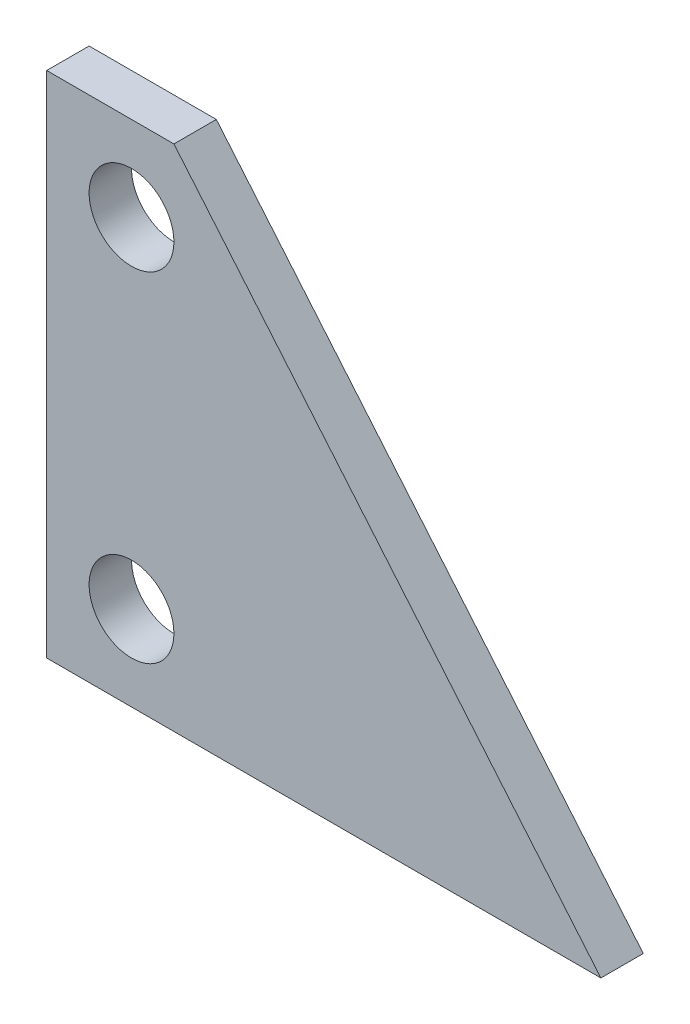
ISO-10303-21;
HEADER;
FILE_DESCRIPTION(('STEP AP214'),'2;1');
FILE_NAME('part.step','',(''),(''),'','','');
FILE_SCHEMA(('AUTOMOTIVE_DESIGN { 1 0 10303 214 1 1 1 1 }'));
ENDSEC;
DATA;
#1=APPLICATION_CONTEXT('core data for automotive mechanical design processes');
#2=APPLICATION_PROTOCOL_DEFINITION('international standard','automotive_design',2000,#1);
#3=PRODUCT_CONTEXT('',#1,'mechanical');
#4=PRODUCT('Part','Part','',(#3));
#5=PRODUCT_RELATED_PRODUCT_CATEGORY('part','',(#4));
#6=PRODUCT_DEFINITION_FORMATION('','',#4);
#7=PRODUCT_DEFINITION_CONTEXT('part definition',#1,'design');
#8=PRODUCT_DEFINITION('design','',#6,#7);
#9=PRODUCT_DEFINITION_SHAPE('','',#8);
#10=(LENGTH_UNIT() NAMED_UNIT(*) SI_UNIT(.MILLI.,.METRE.));
#11=(NAMED_UNIT(*) PLANE_ANGLE_UNIT() SI_UNIT($,.RADIAN.));
#12=(NAMED_UNIT(*) SI_UNIT($,.STERADIAN.) SOLID_ANGLE_UNIT());
#13=UNCERTAINTY_MEASURE_WITH_UNIT(LENGTH_MEASURE(1.E-05),#10,'distance_accuracy_value','');
#14=(GEOMETRIC_REPRESENTATION_CONTEXT(3) GLOBAL_UNCERTAINTY_ASSIGNED_CONTEXT((#13)) GLOBAL_UNIT_ASSIGNED_CONTEXT((#10,
#11,#12)) REPRESENTATION_CONTEXT('',''));
#15=CARTESIAN_POINT('',(0.,0.,0.));
#16=DIRECTION('',(0.,0.,1.));
#17=DIRECTION('',(1.,0.,0.));
#18=AXIS2_PLACEMENT_3D('',#15,#16,#17);
#19=CARTESIAN_POINT('',(0.,0.,3.175));
#20=DIRECTION('',(0.,0.,1.));
#21=DIRECTION('',(1.,0.,0.));
#22=AXIS2_PLACEMENT_3D('',#19,#20,#21);
#23=PLANE('',#22);
#24=CARTESIAN_POINT('',(12.7,63.5,3.175));
#25=DIRECTION('',(0.,0.,1.));
#26=DIRECTION('',(1.,0.,0.));
#27=AXIS2_PLACEMENT_3D('',#24,#25,#26);
#28=CIRCLE('',#27,6.35);
#29=CARTESIAN_POINT('',(19.05,63.5,3.175));
#30=VERTEX_POINT('',#29);
#31=EDGE_CURVE('E100',#30,#30,#28,.T.);
#32=ORIENTED_EDGE('',*,*,#31,.F.);
#33=EDGE_LOOP('',(#32));
#34=FACE_BOUND('',#33,.T.);
#35=DIRECTION('',(0.,-1.,0.));
#36=VECTOR('',#35,1.);
#37=CARTESIAN_POINT('',(0.,76.2,3.175));
#38=LINE('',#37,#36);
#39=CARTESIAN_POINT('',(0.,76.2,3.175));
#40=VERTEX_POINT('',#39);
#41=CARTESIAN_POINT('',(0.,0.,3.175));
#42=VERTEX_POINT('',#41);
#43=EDGE_CURVE('E85',#40,#42,#38,.T.);
#44=ORIENTED_EDGE('',*,*,#43,.T.);
#45=DIRECTION('',(1.,0.,0.));
#46=VECTOR('',#45,1.);
#47=CARTESIAN_POINT('',(0.,0.,3.175));
#48=LINE('',#47,#46);
#49=CARTESIAN_POINT('',(82.9893918957095,0.,3.175));
#50=VERTEX_POINT('',#49);
#51=EDGE_CURVE('E80',#42,#50,#48,.T.);
#52=ORIENTED_EDGE('',*,*,#51,.T.);
#53=DIRECTION('',(-0.642787609686544,0.766044443118974,0.));
#54=VECTOR('',#53,1.);
#55=CARTESIAN_POINT('',(82.9893918957095,0.,3.175));
#56=LINE('',#55,#54);
#57=CARTESIAN_POINT('',(19.05,76.2,3.175));
#58=VERTEX_POINT('',#57);
#59=EDGE_CURVE('E83',#50,#58,#56,.T.);
#60=ORIENTED_EDGE('',*,*,#59,.T.);
#61=DIRECTION('',(-1.,0.,0.));
#62=VECTOR('',#61,1.);
#63=CARTESIAN_POINT('',(19.05,76.2,3.175));
#64=LINE('',#63,#62);
#65=EDGE_CURVE('E50',#58,#40,#64,.T.);
#66=ORIENTED_EDGE('',*,*,#65,.T.);
#67=EDGE_LOOP('',(#44,#52,#60,#66));
#68=FACE_BOUND('',#67,.T.);
#69=CARTESIAN_POINT('',(12.7,12.7,3.175));
#70=DIRECTION('',(0.,0.,1.));
#71=DIRECTION('',(1.,0.,0.));
#72=AXIS2_PLACEMENT_3D('',#69,#70,#71);
#73=CIRCLE('',#72,6.35);
#74=CARTESIAN_POINT('',(19.05,12.7,3.175));
#75=VERTEX_POINT('',#74);
#76=EDGE_CURVE('E115',#75,#75,#73,.T.);
#77=ORIENTED_EDGE('',*,*,#76,.F.);
#78=EDGE_LOOP('',(#77));
#79=FACE_BOUND('',#78,.T.);
#80=ADVANCED_FACE('F33',(#34,#68,#79),#23,.T.);
#81=CARTESIAN_POINT('',(0.,0.,-3.175));
#82=DIRECTION('',(0.,0.,1.));
#83=DIRECTION('',(1.,0.,0.));
#84=AXIS2_PLACEMENT_3D('',#81,#82,#83);
#85=PLANE('',#84);
#86=DIRECTION('',(0.,-1.,0.));
#87=VECTOR('',#86,1.);
#88=CARTESIAN_POINT('',(0.,76.2,-3.175));
#89=LINE('',#88,#87);
#90=CARTESIAN_POINT('',(0.,76.2,-3.175));
#91=VERTEX_POINT('',#90);
#92=CARTESIAN_POINT('',(0.,0.,-3.175));
#93=VERTEX_POINT('',#92);
#94=EDGE_CURVE('E97',#91,#93,#89,.T.);
#95=ORIENTED_EDGE('',*,*,#94,.F.);
#96=DIRECTION('',(-1.,0.,0.));
#97=VECTOR('',#96,1.);
#98=CARTESIAN_POINT('',(19.05,76.2,-3.175));
#99=LINE('',#98,#97);
#100=CARTESIAN_POINT('',(19.05,76.2,-3.175));
#101=VERTEX_POINT('',#100);
#102=EDGE_CURVE('E73',#101,#91,#99,.T.);
#103=ORIENTED_EDGE('',*,*,#102,.F.);
#104=DIRECTION('',(-0.642787609686544,0.766044443118974,0.));
#105=VECTOR('',#104,1.);
#106=CARTESIAN_POINT('',(82.9893918957095,0.,-3.175));
#107=LINE('',#106,#105);
#108=CARTESIAN_POINT('',(82.9893918957095,0.,-3.175));
#109=VERTEX_POINT('',#108);
#110=EDGE_CURVE('E67',#109,#101,#107,.T.);
#111=ORIENTED_EDGE('',*,*,#110,.F.);
#112=DIRECTION('',(1.,0.,0.));
#113=VECTOR('',#112,1.);
#114=CARTESIAN_POINT('',(0.,0.,-3.175));
#115=LINE('',#114,#113);
#116=EDGE_CURVE('E89',#93,#109,#115,.T.);
#117=ORIENTED_EDGE('',*,*,#116,.F.);
#118=EDGE_LOOP('',(#95,#103,#111,#117));
#119=FACE_BOUND('',#118,.T.);
#120=CARTESIAN_POINT('',(12.7,63.5,-3.175));
#121=DIRECTION('',(0.,0.,1.));
#122=DIRECTION('',(1.,0.,0.));
#123=AXIS2_PLACEMENT_3D('',#120,#121,#122);
#124=CIRCLE('',#123,6.35);
#125=CARTESIAN_POINT('',(19.05,63.5,-3.175));
#126=VERTEX_POINT('',#125);
#127=EDGE_CURVE('E112',#126,#126,#124,.T.);
#128=ORIENTED_EDGE('',*,*,#127,.T.);
#129=EDGE_LOOP('',(#128));
#130=FACE_BOUND('',#129,.T.);
#131=CARTESIAN_POINT('',(12.7,12.7,-3.175));
#132=DIRECTION('',(0.,0.,1.));
#133=DIRECTION('',(1.,0.,0.));
#134=AXIS2_PLACEMENT_3D('',#131,#132,#133);
#135=CIRCLE('',#134,6.35);
#136=CARTESIAN_POINT('',(19.05,12.7,-3.175));
#137=VERTEX_POINT('',#136);
#138=EDGE_CURVE('E118',#137,#137,#135,.T.);
#139=ORIENTED_EDGE('',*,*,#138,.T.);
#140=EDGE_LOOP('',(#139));
#141=FACE_BOUND('',#140,.T.);
#142=ADVANCED_FACE('F108',(#119,#130,#141),#85,.F.);
#143=CARTESIAN_POINT('',(0.,76.2,3.175));
#144=DIRECTION('',(1.,0.,0.));
#145=DIRECTION('',(0.,1.,0.));
#146=AXIS2_PLACEMENT_3D('',#143,#144,#145);
#147=PLANE('',#146);
#148=ORIENTED_EDGE('',*,*,#94,.T.);
#149=DIRECTION('',(0.,0.,-1.));
#150=VECTOR('',#149,1.);
#151=CARTESIAN_POINT('',(0.,0.,3.175));
#152=LINE('',#151,#150);
#153=EDGE_CURVE('E11',#42,#93,#152,.T.);
#154=ORIENTED_EDGE('',*,*,#153,.F.);
#155=ORIENTED_EDGE('',*,*,#43,.F.);
#156=DIRECTION('',(0.,0.,-1.));
#157=VECTOR('',#156,1.);
#158=CARTESIAN_POINT('',(0.,76.2,3.175));
#159=LINE('',#158,#157);
#160=EDGE_CURVE('E93',#40,#91,#159,.T.);
#161=ORIENTED_EDGE('',*,*,#160,.T.);
#162=EDGE_LOOP('',(#148,#154,#155,#161));
#163=FACE_BOUND('',#162,.T.);
#164=ADVANCED_FACE('F35',(#163),#147,.F.);
#165=CARTESIAN_POINT('',(0.,0.,3.175));
#166=DIRECTION('',(0.,1.,0.));
#167=DIRECTION('',(0.,0.,1.));
#168=AXIS2_PLACEMENT_3D('',#165,#166,#167);
#169=PLANE('',#168);
#170=ORIENTED_EDGE('',*,*,#116,.T.);
#171=DIRECTION('',(0.,0.,-1.));
#172=VECTOR('',#171,1.);
#173=CARTESIAN_POINT('',(82.9893918957095,0.,3.175));
#174=LINE('',#173,#172);
#175=EDGE_CURVE('E42',#50,#109,#174,.T.);
#176=ORIENTED_EDGE('',*,*,#175,.F.);
#177=ORIENTED_EDGE('',*,*,#51,.F.);
#178=ORIENTED_EDGE('',*,*,#153,.T.);
#179=EDGE_LOOP('',(#170,#176,#177,#178));
#180=FACE_BOUND('',#179,.T.);
#181=ADVANCED_FACE('F88',(#180),#169,.F.);
#182=CARTESIAN_POINT('',(82.9893918957095,0.,3.175));
#183=DIRECTION('',(-0.766044443118974,-0.642787609686544,0.));
#184=DIRECTION('',(0.642787609686544,-0.766044443118974,0.));
#185=AXIS2_PLACEMENT_3D('',#182,#183,#184);
#186=PLANE('',#185);
#187=ORIENTED_EDGE('',*,*,#110,.T.);
#188=DIRECTION('',(0.,0.,-1.));
#189=VECTOR('',#188,1.);
#190=CARTESIAN_POINT('',(19.05,76.2,3.175));
#191=LINE('',#190,#189);
#192=EDGE_CURVE('E90',#58,#101,#191,.T.);
#193=ORIENTED_EDGE('',*,*,#192,.F.);
#194=ORIENTED_EDGE('',*,*,#59,.F.);
#195=ORIENTED_EDGE('',*,*,#175,.T.);
#196=EDGE_LOOP('',(#187,#193,#194,#195));
#197=FACE_BOUND('',#196,.T.);
#198=ADVANCED_FACE('F91',(#197),#186,.F.);
#199=CARTESIAN_POINT('',(19.05,76.2,3.175));
#200=DIRECTION('',(0.,-1.,0.));
#201=DIRECTION('',(0.,0.,-1.));
#202=AXIS2_PLACEMENT_3D('',#199,#200,#201);
#203=PLANE('',#202);
#204=ORIENTED_EDGE('',*,*,#102,.T.);
#205=ORIENTED_EDGE('',*,*,#160,.F.);
#206=ORIENTED_EDGE('',*,*,#65,.F.);
#207=ORIENTED_EDGE('',*,*,#192,.T.);
#208=EDGE_LOOP('',(#204,#205,#206,#207));
#209=FACE_BOUND('',#208,.T.);
#210=ADVANCED_FACE('F105',(#209),#203,.F.);
#211=CARTESIAN_POINT('',(12.7,63.5,3.175));
#212=DIRECTION('',(0.,0.,-1.));
#213=DIRECTION('',(-1.,0.,0.));
#214=AXIS2_PLACEMENT_3D('',#211,#212,#213);
#215=CYLINDRICAL_SURFACE('',#214,6.35);
#216=ORIENTED_EDGE('',*,*,#31,.T.);
#217=EDGE_LOOP('',(#216));
#218=FACE_BOUND('',#217,.T.);
#219=ORIENTED_EDGE('',*,*,#127,.F.);
#220=EDGE_LOOP('',(#219));
#221=FACE_BOUND('',#220,.T.);
#222=ADVANCED_FACE('F135',(#218,#221),#215,.F.);
#223=CARTESIAN_POINT('',(12.7,12.7,3.175));
#224=DIRECTION('',(0.,0.,-1.));
#225=DIRECTION('',(-1.,0.,0.));
#226=AXIS2_PLACEMENT_3D('',#223,#224,#225);
#227=CYLINDRICAL_SURFACE('',#226,6.35);
#228=ORIENTED_EDGE('',*,*,#76,.T.);
#229=EDGE_LOOP('',(#228));
#230=FACE_BOUND('',#229,.T.);
#231=ORIENTED_EDGE('',*,*,#138,.F.);
#232=EDGE_LOOP('',(#231));
#233=FACE_BOUND('',#232,.T.);
#234=ADVANCED_FACE('F124',(#230,#233),#227,.F.);
#235=CLOSED_SHELL('',(#80,#142,#164,#181,#198,#210,#222,#234));
#236=MANIFOLD_SOLID_BREP('B2',#235);
#237=ADVANCED_BREP_SHAPE_REPRESENTATION('',(#18,#236),#14);
#238=SHAPE_DEFINITION_REPRESENTATION(#9,#237);
ENDSEC;
END-ISO-10303-21;
